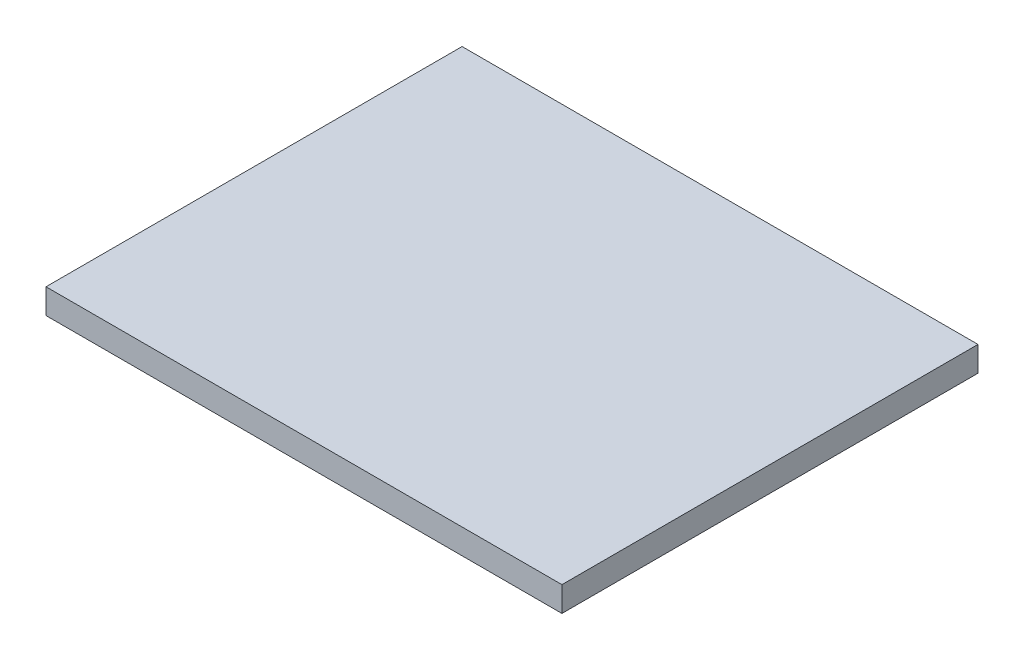
ISO-10303-21;
HEADER;
FILE_DESCRIPTION(('STEP AP214'),'2;1');
FILE_NAME('part.step','',(''),(''),'','','');
FILE_SCHEMA(('AUTOMOTIVE_DESIGN { 1 0 10303 214 1 1 1 1 }'));
ENDSEC;
DATA;
#1=APPLICATION_CONTEXT('core data for automotive mechanical design processes');
#2=APPLICATION_PROTOCOL_DEFINITION('international standard','automotive_design',2000,#1);
#3=PRODUCT_CONTEXT('',#1,'mechanical');
#4=PRODUCT('Part','Part','',(#3));
#5=PRODUCT_RELATED_PRODUCT_CATEGORY('part','',(#4));
#6=PRODUCT_DEFINITION_FORMATION('','',#4);
#7=PRODUCT_DEFINITION_CONTEXT('part definition',#1,'design');
#8=PRODUCT_DEFINITION('design','',#6,#7);
#9=PRODUCT_DEFINITION_SHAPE('','',#8);
#10=(LENGTH_UNIT() NAMED_UNIT(*) SI_UNIT(.MILLI.,.METRE.));
#11=(NAMED_UNIT(*) PLANE_ANGLE_UNIT() SI_UNIT($,.RADIAN.));
#12=(NAMED_UNIT(*) SI_UNIT($,.STERADIAN.) SOLID_ANGLE_UNIT());
#13=UNCERTAINTY_MEASURE_WITH_UNIT(LENGTH_MEASURE(1.E-05),#10,'distance_accuracy_value','');
#14=(GEOMETRIC_REPRESENTATION_CONTEXT(3) GLOBAL_UNCERTAINTY_ASSIGNED_CONTEXT((#13)) GLOBAL_UNIT_ASSIGNED_CONTEXT((#10,
#11,#12)) REPRESENTATION_CONTEXT('',''));
#15=CARTESIAN_POINT('',(0.,0.,0.));
#16=DIRECTION('',(0.,0.,1.));
#17=DIRECTION('',(1.,0.,0.));
#18=AXIS2_PLACEMENT_3D('',#15,#16,#17);
#19=CARTESIAN_POINT('',(155.,15.,-125.));
#20=DIRECTION('',(-1.,0.,0.));
#21=DIRECTION('',(0.,0.,1.));
#22=AXIS2_PLACEMENT_3D('',#19,#20,#21);
#23=PLANE('',#22);
#24=DIRECTION('',(0.,0.,-1.));
#25=VECTOR('',#24,1.);
#26=CARTESIAN_POINT('',(155.,0.,-125.));
#27=LINE('',#26,#25);
#28=CARTESIAN_POINT('',(155.,0.,125.));
#29=VERTEX_POINT('',#28);
#30=CARTESIAN_POINT('',(155.,0.,-125.));
#31=VERTEX_POINT('',#30);
#32=EDGE_CURVE('E102',#29,#31,#27,.T.);
#33=ORIENTED_EDGE('',*,*,#32,.T.);
#34=DIRECTION('',(0.,-1.,0.));
#35=VECTOR('',#34,1.);
#36=CARTESIAN_POINT('',(155.,15.,-125.));
#37=LINE('',#36,#35);
#38=CARTESIAN_POINT('',(155.,15.,-125.));
#39=VERTEX_POINT('',#38);
#40=EDGE_CURVE('E11',#39,#31,#37,.T.);
#41=ORIENTED_EDGE('',*,*,#40,.F.);
#42=DIRECTION('',(0.,0.,-1.));
#43=VECTOR('',#42,1.);
#44=CARTESIAN_POINT('',(155.,15.,-125.));
#45=LINE('',#44,#43);
#46=CARTESIAN_POINT('',(155.,15.,125.));
#47=VERTEX_POINT('',#46);
#48=EDGE_CURVE('E90',#47,#39,#45,.T.);
#49=ORIENTED_EDGE('',*,*,#48,.F.);
#50=DIRECTION('',(0.,-1.,0.));
#51=VECTOR('',#50,1.);
#52=CARTESIAN_POINT('',(155.,15.,125.));
#53=LINE('',#52,#51);
#54=EDGE_CURVE('E98',#47,#29,#53,.T.);
#55=ORIENTED_EDGE('',*,*,#54,.T.);
#56=EDGE_LOOP('',(#33,#41,#49,#55));
#57=FACE_BOUND('',#56,.T.);
#58=ADVANCED_FACE('F39',(#57),#23,.F.);
#59=CARTESIAN_POINT('',(-155.,15.,-125.));
#60=DIRECTION('',(0.,0.,1.));
#61=DIRECTION('',(1.,0.,0.));
#62=AXIS2_PLACEMENT_3D('',#59,#60,#61);
#63=PLANE('',#62);
#64=DIRECTION('',(-1.,0.,0.));
#65=VECTOR('',#64,1.);
#66=CARTESIAN_POINT('',(-155.,0.,-125.));
#67=LINE('',#66,#65);
#68=CARTESIAN_POINT('',(-155.,0.,-125.));
#69=VERTEX_POINT('',#68);
#70=EDGE_CURVE('E94',#31,#69,#67,.T.);
#71=ORIENTED_EDGE('',*,*,#70,.T.);
#72=DIRECTION('',(0.,-1.,0.));
#73=VECTOR('',#72,1.);
#74=CARTESIAN_POINT('',(-155.,15.,-125.));
#75=LINE('',#74,#73);
#76=CARTESIAN_POINT('',(-155.,15.,-125.));
#77=VERTEX_POINT('',#76);
#78=EDGE_CURVE('E47',#77,#69,#75,.T.);
#79=ORIENTED_EDGE('',*,*,#78,.F.);
#80=DIRECTION('',(-1.,0.,0.));
#81=VECTOR('',#80,1.);
#82=CARTESIAN_POINT('',(-155.,15.,-125.));
#83=LINE('',#82,#81);
#84=EDGE_CURVE('E85',#39,#77,#83,.T.);
#85=ORIENTED_EDGE('',*,*,#84,.F.);
#86=ORIENTED_EDGE('',*,*,#40,.T.);
#87=EDGE_LOOP('',(#71,#79,#85,#86));
#88=FACE_BOUND('',#87,.T.);
#89=ADVANCED_FACE('F93',(#88),#63,.F.);
#90=CARTESIAN_POINT('',(-155.,15.,-125.));
#91=DIRECTION('',(1.,0.,0.));
#92=DIRECTION('',(0.,0.,-1.));
#93=AXIS2_PLACEMENT_3D('',#90,#91,#92);
#94=PLANE('',#93);
#95=DIRECTION('',(0.,0.,1.));
#96=VECTOR('',#95,1.);
#97=CARTESIAN_POINT('',(-155.,0.,-125.));
#98=LINE('',#97,#96);
#99=CARTESIAN_POINT('',(-155.,0.,125.));
#100=VERTEX_POINT('',#99);
#101=EDGE_CURVE('E72',#69,#100,#98,.T.);
#102=ORIENTED_EDGE('',*,*,#101,.T.);
#103=DIRECTION('',(0.,-1.,0.));
#104=VECTOR('',#103,1.);
#105=CARTESIAN_POINT('',(-155.,15.,125.));
#106=LINE('',#105,#104);
#107=CARTESIAN_POINT('',(-155.,15.,125.));
#108=VERTEX_POINT('',#107);
#109=EDGE_CURVE('E95',#108,#100,#106,.T.);
#110=ORIENTED_EDGE('',*,*,#109,.F.);
#111=DIRECTION('',(0.,0.,1.));
#112=VECTOR('',#111,1.);
#113=CARTESIAN_POINT('',(-155.,15.,-125.));
#114=LINE('',#113,#112);
#115=EDGE_CURVE('E88',#77,#108,#114,.T.);
#116=ORIENTED_EDGE('',*,*,#115,.F.);
#117=ORIENTED_EDGE('',*,*,#78,.T.);
#118=EDGE_LOOP('',(#102,#110,#116,#117));
#119=FACE_BOUND('',#118,.T.);
#120=ADVANCED_FACE('F96',(#119),#94,.F.);
#121=CARTESIAN_POINT('',(-155.,15.,125.));
#122=DIRECTION('',(0.,0.,-1.));
#123=DIRECTION('',(-1.,0.,0.));
#124=AXIS2_PLACEMENT_3D('',#121,#122,#123);
#125=PLANE('',#124);
#126=DIRECTION('',(1.,0.,0.));
#127=VECTOR('',#126,1.);
#128=CARTESIAN_POINT('',(-155.,0.,125.));
#129=LINE('',#128,#127);
#130=EDGE_CURVE('E78',#100,#29,#129,.T.);
#131=ORIENTED_EDGE('',*,*,#130,.T.);
#132=ORIENTED_EDGE('',*,*,#54,.F.);
#133=DIRECTION('',(1.,0.,0.));
#134=VECTOR('',#133,1.);
#135=CARTESIAN_POINT('',(-155.,15.,125.));
#136=LINE('',#135,#134);
#137=EDGE_CURVE('E55',#108,#47,#136,.T.);
#138=ORIENTED_EDGE('',*,*,#137,.F.);
#139=ORIENTED_EDGE('',*,*,#109,.T.);
#140=EDGE_LOOP('',(#131,#132,#138,#139));
#141=FACE_BOUND('',#140,.T.);
#142=ADVANCED_FACE('F109',(#141),#125,.F.);
#143=CARTESIAN_POINT('',(0.,15.,0.));
#144=DIRECTION('',(0.,1.,0.));
#145=DIRECTION('',(0.,0.,1.));
#146=AXIS2_PLACEMENT_3D('',#143,#144,#145);
#147=PLANE('',#146);
#148=ORIENTED_EDGE('',*,*,#48,.T.);
#149=ORIENTED_EDGE('',*,*,#84,.T.);
#150=ORIENTED_EDGE('',*,*,#115,.T.);
#151=ORIENTED_EDGE('',*,*,#137,.T.);
#152=EDGE_LOOP('',(#148,#149,#150,#151));
#153=FACE_BOUND('',#152,.T.);
#154=ADVANCED_FACE('F86',(#153),#147,.T.);
#155=CARTESIAN_POINT('',(0.,0.,0.));
#156=DIRECTION('',(0.,1.,0.));
#157=DIRECTION('',(0.,0.,1.));
#158=AXIS2_PLACEMENT_3D('',#155,#156,#157);
#159=PLANE('',#158);
#160=ORIENTED_EDGE('',*,*,#32,.F.);
#161=ORIENTED_EDGE('',*,*,#130,.F.);
#162=ORIENTED_EDGE('',*,*,#101,.F.);
#163=ORIENTED_EDGE('',*,*,#70,.F.);
#164=EDGE_LOOP('',(#160,#161,#162,#163));
#165=FACE_BOUND('',#164,.T.);
#166=ADVANCED_FACE('F112',(#165),#159,.F.);
#167=CLOSED_SHELL('',(#58,#89,#120,#142,#154,#166));
#168=MANIFOLD_SOLID_BREP('B2',#167);
#169=ADVANCED_BREP_SHAPE_REPRESENTATION('',(#18,#168),#14);
#170=SHAPE_DEFINITION_REPRESENTATION(#9,#169);
ENDSEC;
END-ISO-10303-21;
